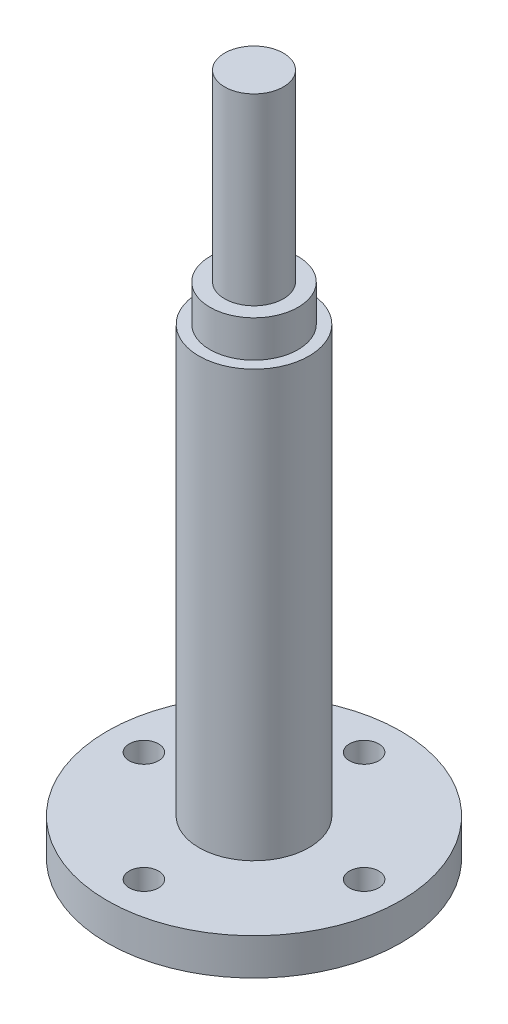
ISO-10303-21;
HEADER;
FILE_DESCRIPTION(('STEP AP214'),'2;1');
FILE_NAME('part.step','',(''),(''),'','','');
FILE_SCHEMA(('AUTOMOTIVE_DESIGN { 1 0 10303 214 1 1 1 1 }'));
ENDSEC;
DATA;
#1=APPLICATION_CONTEXT('core data for automotive mechanical design processes');
#2=APPLICATION_PROTOCOL_DEFINITION('international standard','automotive_design',2000,#1);
#3=PRODUCT_CONTEXT('',#1,'mechanical');
#4=PRODUCT('Part','Part','',(#3));
#5=PRODUCT_RELATED_PRODUCT_CATEGORY('part','',(#4));
#6=PRODUCT_DEFINITION_FORMATION('','',#4);
#7=PRODUCT_DEFINITION_CONTEXT('part definition',#1,'design');
#8=PRODUCT_DEFINITION('design','',#6,#7);
#9=PRODUCT_DEFINITION_SHAPE('','',#8);
#10=(LENGTH_UNIT() NAMED_UNIT(*) SI_UNIT(.MILLI.,.METRE.));
#11=(NAMED_UNIT(*) PLANE_ANGLE_UNIT() SI_UNIT($,.RADIAN.));
#12=(NAMED_UNIT(*) SI_UNIT($,.STERADIAN.) SOLID_ANGLE_UNIT());
#13=UNCERTAINTY_MEASURE_WITH_UNIT(LENGTH_MEASURE(1.E-05),#10,'distance_accuracy_value','');
#14=(GEOMETRIC_REPRESENTATION_CONTEXT(3) GLOBAL_UNCERTAINTY_ASSIGNED_CONTEXT((#13)) GLOBAL_UNIT_ASSIGNED_CONTEXT((#10,
#11,#12)) REPRESENTATION_CONTEXT('',''));
#15=CARTESIAN_POINT('',(0.,0.,0.));
#16=DIRECTION('',(0.,0.,1.));
#17=DIRECTION('',(1.,0.,0.));
#18=AXIS2_PLACEMENT_3D('',#15,#16,#17);
#19=CARTESIAN_POINT('',(0.,68.,0.));
#20=DIRECTION('',(0.,-1.,0.));
#21=DIRECTION('',(0.,0.,-1.));
#22=AXIS2_PLACEMENT_3D('',#19,#20,#21);
#23=CYLINDRICAL_SURFACE('',#22,7.5);
#24=CARTESIAN_POINT('',(0.,5.,0.));
#25=DIRECTION('',(0.,1.,0.));
#26=DIRECTION('',(0.,0.,1.));
#27=AXIS2_PLACEMENT_3D('',#24,#25,#26);
#28=CIRCLE('',#27,7.5);
#29=CARTESIAN_POINT('',(0.,5.,7.5));
#30=VERTEX_POINT('',#29);
#31=EDGE_CURVE('E50',#30,#30,#28,.T.);
#32=ORIENTED_EDGE('',*,*,#31,.T.);
#33=EDGE_LOOP('',(#32));
#34=FACE_BOUND('',#33,.T.);
#35=CARTESIAN_POINT('',(0.,63.,0.));
#36=DIRECTION('',(0.,1.,0.));
#37=DIRECTION('',(0.,0.,1.));
#38=AXIS2_PLACEMENT_3D('',#35,#36,#37);
#39=CIRCLE('',#38,7.5);
#40=CARTESIAN_POINT('',(0.,63.,7.5));
#41=VERTEX_POINT('',#40);
#42=EDGE_CURVE('E168',#41,#41,#39,.T.);
#43=ORIENTED_EDGE('',*,*,#42,.F.);
#44=EDGE_LOOP('',(#43));
#45=FACE_BOUND('',#44,.T.);
#46=ADVANCED_FACE('F41',(#34,#45),#23,.T.);
#47=CARTESIAN_POINT('',(0.,5.,0.));
#48=DIRECTION('',(0.,-1.,0.));
#49=DIRECTION('',(0.,0.,-1.));
#50=AXIS2_PLACEMENT_3D('',#47,#48,#49);
#51=CYLINDRICAL_SURFACE('',#50,20.);
#52=CARTESIAN_POINT('',(0.,5.,0.));
#53=DIRECTION('',(0.,1.,0.));
#54=DIRECTION('',(0.,0.,1.));
#55=AXIS2_PLACEMENT_3D('',#52,#53,#54);
#56=CIRCLE('',#55,20.);
#57=CARTESIAN_POINT('',(0.,5.,20.));
#58=VERTEX_POINT('',#57);
#59=EDGE_CURVE('E56',#58,#58,#56,.T.);
#60=ORIENTED_EDGE('',*,*,#59,.F.);
#61=EDGE_LOOP('',(#60));
#62=FACE_BOUND('',#61,.T.);
#63=CARTESIAN_POINT('',(0.,0.,0.));
#64=DIRECTION('',(0.,1.,0.));
#65=DIRECTION('',(0.,0.,1.));
#66=AXIS2_PLACEMENT_3D('',#63,#64,#65);
#67=CIRCLE('',#66,20.);
#68=CARTESIAN_POINT('',(0.,0.,20.));
#69=VERTEX_POINT('',#68);
#70=EDGE_CURVE('E65',#69,#69,#67,.T.);
#71=ORIENTED_EDGE('',*,*,#70,.T.);
#72=EDGE_LOOP('',(#71));
#73=FACE_BOUND('',#72,.T.);
#74=ADVANCED_FACE('F43',(#62,#73),#51,.T.);
#75=CARTESIAN_POINT('',(0.,5.,0.));
#76=DIRECTION('',(0.,1.,0.));
#77=DIRECTION('',(0.,0.,1.));
#78=AXIS2_PLACEMENT_3D('',#75,#76,#77);
#79=PLANE('',#78);
#80=CARTESIAN_POINT('',(0.,5.,-15.));
#81=DIRECTION('',(0.,1.,0.));
#82=DIRECTION('',(0.,0.,1.));
#83=AXIS2_PLACEMENT_3D('',#80,#81,#82);
#84=CIRCLE('',#83,2.);
#85=CARTESIAN_POINT('',(0.,5.,-13.));
#86=VERTEX_POINT('',#85);
#87=EDGE_CURVE('E74',#86,#86,#84,.T.);
#88=ORIENTED_EDGE('',*,*,#87,.F.);
#89=EDGE_LOOP('',(#88));
#90=FACE_BOUND('',#89,.T.);
#91=CARTESIAN_POINT('',(15.0000000000004,5.,-4.23570186157979E-13));
#92=DIRECTION('',(0.,1.,0.));
#93=DIRECTION('',(0.,0.,1.));
#94=AXIS2_PLACEMENT_3D('',#91,#92,#93);
#95=CIRCLE('',#94,2.00000000000033);
#96=CARTESIAN_POINT('',(15.0000000000004,5.,1.99999999999991));
#97=VERTEX_POINT('',#96);
#98=EDGE_CURVE('E178',#97,#97,#95,.T.);
#99=ORIENTED_EDGE('',*,*,#98,.F.);
#100=EDGE_LOOP('',(#99));
#101=FACE_BOUND('',#100,.T.);
#102=CARTESIAN_POINT('',(8.47140372315957E-13,5.,15.));
#103=DIRECTION('',(0.,1.,0.));
#104=DIRECTION('',(0.,0.,1.));
#105=AXIS2_PLACEMENT_3D('',#102,#103,#104);
#106=CIRCLE('',#105,2.00000000000091);
#107=CARTESIAN_POINT('',(8.47140372315957E-13,5.,17.0000000000009));
#108=VERTEX_POINT('',#107);
#109=EDGE_CURVE('E182',#108,#108,#106,.T.);
#110=ORIENTED_EDGE('',*,*,#109,.F.);
#111=EDGE_LOOP('',(#110));
#112=FACE_BOUND('',#111,.T.);
#113=CARTESIAN_POINT('',(-14.9999999999996,5.,4.254071563567E-13));
#114=DIRECTION('',(0.,1.,0.));
#115=DIRECTION('',(0.,0.,1.));
#116=AXIS2_PLACEMENT_3D('',#113,#114,#115);
#117=CIRCLE('',#116,2.00000000000068);
#118=CARTESIAN_POINT('',(-14.9999999999996,5.,2.00000000000111));
#119=VERTEX_POINT('',#118);
#120=EDGE_CURVE('E174',#119,#119,#117,.T.);
#121=ORIENTED_EDGE('',*,*,#120,.F.);
#122=EDGE_LOOP('',(#121));
#123=FACE_BOUND('',#122,.T.);
#124=ORIENTED_EDGE('',*,*,#31,.F.);
#125=EDGE_LOOP('',(#124));
#126=FACE_BOUND('',#125,.T.);
#127=ORIENTED_EDGE('',*,*,#59,.T.);
#128=EDGE_LOOP('',(#127));
#129=FACE_BOUND('',#128,.T.);
#130=ADVANCED_FACE('F110',(#90,#101,#112,#123,#126,#129),#79,.T.);
#131=CARTESIAN_POINT('',(0.,0.,0.));
#132=DIRECTION('',(0.,1.,0.));
#133=DIRECTION('',(0.,0.,1.));
#134=AXIS2_PLACEMENT_3D('',#131,#132,#133);
#135=PLANE('',#134);
#136=CARTESIAN_POINT('',(0.,0.,-15.));
#137=DIRECTION('',(0.,1.,0.));
#138=DIRECTION('',(0.,0.,1.));
#139=AXIS2_PLACEMENT_3D('',#136,#137,#138);
#140=CIRCLE('',#139,2.);
#141=CARTESIAN_POINT('',(0.,0.,-13.));
#142=VERTEX_POINT('',#141);
#143=EDGE_CURVE('E45',#142,#142,#140,.T.);
#144=ORIENTED_EDGE('',*,*,#143,.T.);
#145=EDGE_LOOP('',(#144));
#146=FACE_BOUND('',#145,.T.);
#147=CARTESIAN_POINT('',(15.0000000000004,0.,-4.23570186157979E-13));
#148=DIRECTION('',(0.,1.,0.));
#149=DIRECTION('',(0.,0.,1.));
#150=AXIS2_PLACEMENT_3D('',#147,#148,#149);
#151=CIRCLE('',#150,2.00000000000033);
#152=CARTESIAN_POINT('',(15.0000000000004,0.,1.99999999999991));
#153=VERTEX_POINT('',#152);
#154=EDGE_CURVE('E77',#153,#153,#151,.T.);
#155=ORIENTED_EDGE('',*,*,#154,.T.);
#156=EDGE_LOOP('',(#155));
#157=FACE_BOUND('',#156,.T.);
#158=CARTESIAN_POINT('',(8.47140372315957E-13,0.,15.));
#159=DIRECTION('',(0.,1.,0.));
#160=DIRECTION('',(0.,0.,1.));
#161=AXIS2_PLACEMENT_3D('',#158,#159,#160);
#162=CIRCLE('',#161,2.00000000000091);
#163=CARTESIAN_POINT('',(8.47140372315957E-13,0.,17.0000000000009));
#164=VERTEX_POINT('',#163);
#165=EDGE_CURVE('E73',#164,#164,#162,.T.);
#166=ORIENTED_EDGE('',*,*,#165,.T.);
#167=EDGE_LOOP('',(#166));
#168=FACE_BOUND('',#167,.T.);
#169=CARTESIAN_POINT('',(-14.9999999999996,0.,4.254071563567E-13));
#170=DIRECTION('',(0.,1.,0.));
#171=DIRECTION('',(0.,0.,1.));
#172=AXIS2_PLACEMENT_3D('',#169,#170,#171);
#173=CIRCLE('',#172,2.00000000000068);
#174=CARTESIAN_POINT('',(-14.9999999999996,0.,2.00000000000111));
#175=VERTEX_POINT('',#174);
#176=EDGE_CURVE('E69',#175,#175,#173,.T.);
#177=ORIENTED_EDGE('',*,*,#176,.T.);
#178=EDGE_LOOP('',(#177));
#179=FACE_BOUND('',#178,.T.);
#180=ORIENTED_EDGE('',*,*,#70,.F.);
#181=EDGE_LOOP('',(#180));
#182=FACE_BOUND('',#181,.T.);
#183=ADVANCED_FACE('F115',(#146,#157,#168,#179,#182),#135,.F.);
#184=CARTESIAN_POINT('',(-14.9999999999996,-20.,4.254071563567E-13));
#185=DIRECTION('',(0.,1.,0.));
#186=DIRECTION('',(0.,0.,1.));
#187=AXIS2_PLACEMENT_3D('',#184,#185,#186);
#188=CYLINDRICAL_SURFACE('',#187,2.00000000000068);
#189=ORIENTED_EDGE('',*,*,#120,.T.);
#190=EDGE_LOOP('',(#189));
#191=FACE_BOUND('',#190,.T.);
#192=ORIENTED_EDGE('',*,*,#176,.F.);
#193=EDGE_LOOP('',(#192));
#194=FACE_BOUND('',#193,.T.);
#195=ADVANCED_FACE('F118',(#191,#194),#188,.F.);
#196=CARTESIAN_POINT('',(8.47140372315957E-13,-20.,15.));
#197=DIRECTION('',(0.,1.,0.));
#198=DIRECTION('',(0.,0.,1.));
#199=AXIS2_PLACEMENT_3D('',#196,#197,#198);
#200=CYLINDRICAL_SURFACE('',#199,2.00000000000091);
#201=ORIENTED_EDGE('',*,*,#109,.T.);
#202=EDGE_LOOP('',(#201));
#203=FACE_BOUND('',#202,.T.);
#204=ORIENTED_EDGE('',*,*,#165,.F.);
#205=EDGE_LOOP('',(#204));
#206=FACE_BOUND('',#205,.T.);
#207=ADVANCED_FACE('F122',(#203,#206),#200,.F.);
#208=CARTESIAN_POINT('',(15.0000000000004,-20.,-4.23570186157979E-13));
#209=DIRECTION('',(0.,1.,0.));
#210=DIRECTION('',(0.,0.,1.));
#211=AXIS2_PLACEMENT_3D('',#208,#209,#210);
#212=CYLINDRICAL_SURFACE('',#211,2.00000000000033);
#213=ORIENTED_EDGE('',*,*,#98,.T.);
#214=EDGE_LOOP('',(#213));
#215=FACE_BOUND('',#214,.T.);
#216=ORIENTED_EDGE('',*,*,#154,.F.);
#217=EDGE_LOOP('',(#216));
#218=FACE_BOUND('',#217,.T.);
#219=ADVANCED_FACE('F135',(#215,#218),#212,.F.);
#220=CARTESIAN_POINT('',(0.,-20.,-15.));
#221=DIRECTION('',(0.,1.,0.));
#222=DIRECTION('',(0.,0.,1.));
#223=AXIS2_PLACEMENT_3D('',#220,#221,#222);
#224=CYLINDRICAL_SURFACE('',#223,2.);
#225=ORIENTED_EDGE('',*,*,#87,.T.);
#226=EDGE_LOOP('',(#225));
#227=FACE_BOUND('',#226,.T.);
#228=ORIENTED_EDGE('',*,*,#143,.F.);
#229=EDGE_LOOP('',(#228));
#230=FACE_BOUND('',#229,.T.);
#231=ADVANCED_FACE('F141',(#227,#230),#224,.F.);
#232=CARTESIAN_POINT('',(0.,63.,0.));
#233=DIRECTION('',(0.,1.,0.));
#234=DIRECTION('',(0.,0.,1.));
#235=AXIS2_PLACEMENT_3D('',#232,#233,#234);
#236=PLANE('',#235);
#237=CARTESIAN_POINT('',(0.,63.,0.));
#238=DIRECTION('',(0.,1.,0.));
#239=DIRECTION('',(0.,0.,1.));
#240=AXIS2_PLACEMENT_3D('',#237,#238,#239);
#241=CIRCLE('',#240,6.);
#242=CARTESIAN_POINT('',(0.,63.,6.));
#243=VERTEX_POINT('',#242);
#244=EDGE_CURVE('E160',#243,#243,#241,.T.);
#245=ORIENTED_EDGE('',*,*,#244,.F.);
#246=EDGE_LOOP('',(#245));
#247=FACE_BOUND('',#246,.T.);
#248=ORIENTED_EDGE('',*,*,#42,.T.);
#249=EDGE_LOOP('',(#248));
#250=FACE_BOUND('',#249,.T.);
#251=ADVANCED_FACE('F148',(#247,#250),#236,.T.);
#252=CARTESIAN_POINT('',(0.,63.,0.));
#253=DIRECTION('',(0.,1.,0.));
#254=DIRECTION('',(0.,0.,1.));
#255=AXIS2_PLACEMENT_3D('',#252,#253,#254);
#256=CYLINDRICAL_SURFACE('',#255,6.);
#257=ORIENTED_EDGE('',*,*,#244,.T.);
#258=EDGE_LOOP('',(#257));
#259=FACE_BOUND('',#258,.T.);
#260=CARTESIAN_POINT('',(0.,68.,0.));
#261=DIRECTION('',(0.,1.,0.));
#262=DIRECTION('',(0.,0.,1.));
#263=AXIS2_PLACEMENT_3D('',#260,#261,#262);
#264=CIRCLE('',#263,6.);
#265=CARTESIAN_POINT('',(0.,68.,6.));
#266=VERTEX_POINT('',#265);
#267=EDGE_CURVE('E163',#266,#266,#264,.T.);
#268=ORIENTED_EDGE('',*,*,#267,.F.);
#269=EDGE_LOOP('',(#268));
#270=FACE_BOUND('',#269,.T.);
#271=ADVANCED_FACE('F102',(#259,#270),#256,.T.);
#272=CARTESIAN_POINT('',(0.,93.,0.));
#273=DIRECTION('',(0.,1.,0.));
#274=DIRECTION('',(0.,0.,1.));
#275=AXIS2_PLACEMENT_3D('',#272,#273,#274);
#276=PLANE('',#275);
#277=CARTESIAN_POINT('',(0.,93.,0.));
#278=DIRECTION('',(0.,1.,0.));
#279=DIRECTION('',(0.,0.,1.));
#280=AXIS2_PLACEMENT_3D('',#277,#278,#279);
#281=CIRCLE('',#280,4.);
#282=CARTESIAN_POINT('',(0.,93.,4.));
#283=VERTEX_POINT('',#282);
#284=EDGE_CURVE('E59',#283,#283,#281,.T.);
#285=ORIENTED_EDGE('',*,*,#284,.T.);
#286=EDGE_LOOP('',(#285));
#287=FACE_BOUND('',#286,.T.);
#288=ADVANCED_FACE('F90',(#287),#276,.T.);
#289=CARTESIAN_POINT('',(0.,93.,0.));
#290=DIRECTION('',(0.,-1.,0.));
#291=DIRECTION('',(0.,0.,-1.));
#292=AXIS2_PLACEMENT_3D('',#289,#290,#291);
#293=CYLINDRICAL_SURFACE('',#292,4.);
#294=ORIENTED_EDGE('',*,*,#284,.F.);
#295=EDGE_LOOP('',(#294));
#296=FACE_BOUND('',#295,.T.);
#297=CARTESIAN_POINT('',(0.,68.,0.));
#298=DIRECTION('',(0.,1.,0.));
#299=DIRECTION('',(0.,0.,1.));
#300=AXIS2_PLACEMENT_3D('',#297,#298,#299);
#301=CIRCLE('',#300,4.);
#302=CARTESIAN_POINT('',(0.,68.,4.));
#303=VERTEX_POINT('',#302);
#304=EDGE_CURVE('E10',#303,#303,#301,.T.);
#305=ORIENTED_EDGE('',*,*,#304,.T.);
#306=EDGE_LOOP('',(#305));
#307=FACE_BOUND('',#306,.T.);
#308=ADVANCED_FACE('F92',(#296,#307),#293,.T.);
#309=CARTESIAN_POINT('',(0.,68.,0.));
#310=DIRECTION('',(0.,1.,0.));
#311=DIRECTION('',(0.,0.,1.));
#312=AXIS2_PLACEMENT_3D('',#309,#310,#311);
#313=PLANE('',#312);
#314=ORIENTED_EDGE('',*,*,#304,.F.);
#315=EDGE_LOOP('',(#314));
#316=FACE_BOUND('',#315,.T.);
#317=ORIENTED_EDGE('',*,*,#267,.T.);
#318=EDGE_LOOP('',(#317));
#319=FACE_BOUND('',#318,.T.);
#320=ADVANCED_FACE('F94',(#316,#319),#313,.T.);
#321=CLOSED_SHELL('',(#46,#74,#130,#183,#195,#207,#219,#231,#251,#271,#288,#308,#320));
#322=MANIFOLD_SOLID_BREP('B2',#321);
#323=ADVANCED_BREP_SHAPE_REPRESENTATION('',(#18,#322),#14);
#324=SHAPE_DEFINITION_REPRESENTATION(#9,#323);
ENDSEC;
END-ISO-10303-21;
